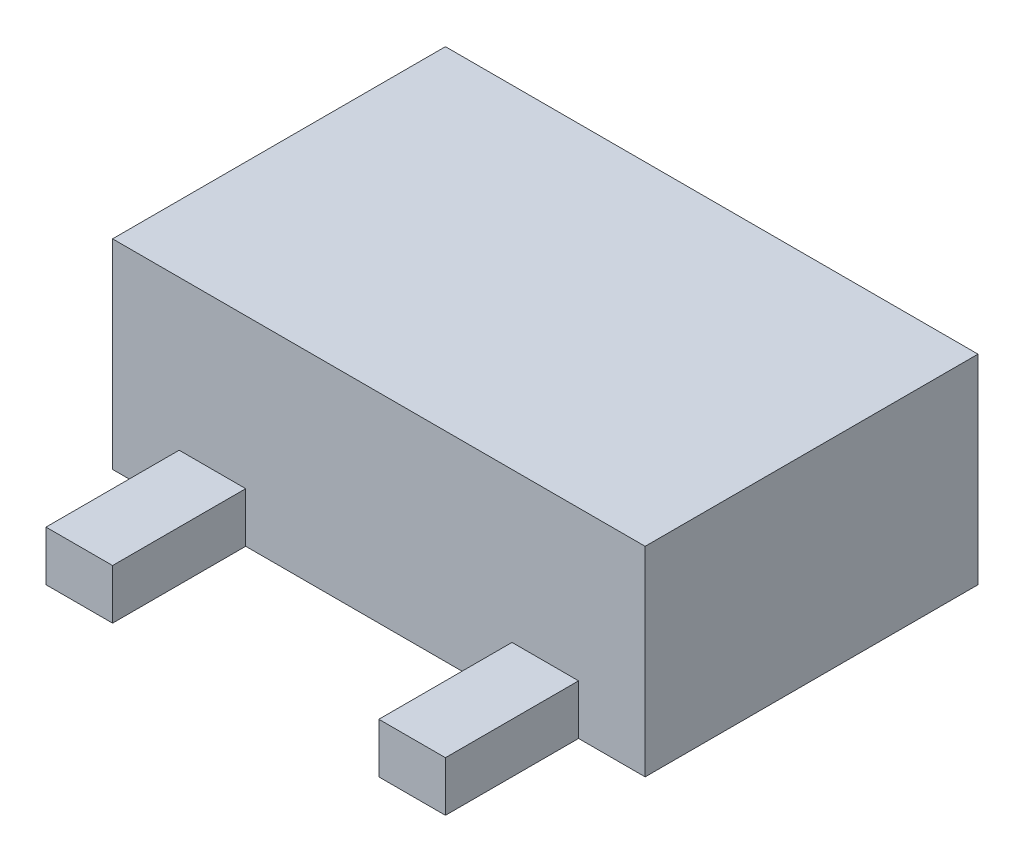
ISO-10303-21;
HEADER;
FILE_DESCRIPTION(('STEP AP214'),'2;1');
FILE_NAME('part.step','',(''),(''),'','','');
FILE_SCHEMA(('AUTOMOTIVE_DESIGN { 1 0 10303 214 1 1 1 1 }'));
ENDSEC;
DATA;
#1=APPLICATION_CONTEXT('core data for automotive mechanical design processes');
#2=APPLICATION_PROTOCOL_DEFINITION('international standard','automotive_design',2000,#1);
#3=PRODUCT_CONTEXT('',#1,'mechanical');
#4=PRODUCT('Part','Part','',(#3));
#5=PRODUCT_RELATED_PRODUCT_CATEGORY('part','',(#4));
#6=PRODUCT_DEFINITION_FORMATION('','',#4);
#7=PRODUCT_DEFINITION_CONTEXT('part definition',#1,'design');
#8=PRODUCT_DEFINITION('design','',#6,#7);
#9=PRODUCT_DEFINITION_SHAPE('','',#8);
#10=(LENGTH_UNIT() NAMED_UNIT(*) SI_UNIT(.MILLI.,.METRE.));
#11=(NAMED_UNIT(*) PLANE_ANGLE_UNIT() SI_UNIT($,.RADIAN.));
#12=(NAMED_UNIT(*) SI_UNIT($,.STERADIAN.) SOLID_ANGLE_UNIT());
#13=UNCERTAINTY_MEASURE_WITH_UNIT(LENGTH_MEASURE(1.E-05),#10,'distance_accuracy_value','');
#14=(GEOMETRIC_REPRESENTATION_CONTEXT(3) GLOBAL_UNCERTAINTY_ASSIGNED_CONTEXT((#13)) GLOBAL_UNIT_ASSIGNED_CONTEXT((#10,
#11,#12)) REPRESENTATION_CONTEXT('',''));
#15=CARTESIAN_POINT('',(0.,0.,0.));
#16=DIRECTION('',(0.,0.,1.));
#17=DIRECTION('',(1.,0.,0.));
#18=AXIS2_PLACEMENT_3D('',#15,#16,#17);
#19=CARTESIAN_POINT('',(-0.8,0.6,0.5));
#20=DIRECTION('',(0.,0.,-1.));
#21=DIRECTION('',(-1.,0.,0.));
#22=AXIS2_PLACEMENT_3D('',#19,#20,#21);
#23=PLANE('',#22);
#24=DIRECTION('',(-1.,0.,0.));
#25=VECTOR('',#24,1.);
#26=CARTESIAN_POINT('',(0.6,0.15,0.5));
#27=LINE('',#26,#25);
#28=CARTESIAN_POINT('',(0.6,0.15,0.5));
#29=VERTEX_POINT('',#28);
#30=CARTESIAN_POINT('',(0.4,0.15,0.5));
#31=VERTEX_POINT('',#30);
#32=EDGE_CURVE('E58',#29,#31,#27,.T.);
#33=ORIENTED_EDGE('',*,*,#32,.F.);
#34=DIRECTION('',(0.,-1.,0.));
#35=VECTOR('',#34,1.);
#36=CARTESIAN_POINT('',(0.6,0.597213595499958,0.5));
#37=LINE('',#36,#35);
#38=CARTESIAN_POINT('',(0.6,0.,0.5));
#39=VERTEX_POINT('',#38);
#40=EDGE_CURVE('E166',#29,#39,#37,.T.);
#41=ORIENTED_EDGE('',*,*,#40,.T.);
#42=DIRECTION('',(1.,0.,0.));
#43=VECTOR('',#42,1.);
#44=CARTESIAN_POINT('',(-0.8,0.,0.5));
#45=LINE('',#44,#43);
#46=CARTESIAN_POINT('',(0.8,0.,0.5));
#47=VERTEX_POINT('',#46);
#48=EDGE_CURVE('E151',#39,#47,#45,.T.);
#49=ORIENTED_EDGE('',*,*,#48,.T.);
#50=DIRECTION('',(0.,-1.,0.));
#51=VECTOR('',#50,1.);
#52=CARTESIAN_POINT('',(0.8,0.6,0.5));
#53=LINE('',#52,#51);
#54=CARTESIAN_POINT('',(0.8,0.6,0.5));
#55=VERTEX_POINT('',#54);
#56=EDGE_CURVE('E253',#55,#47,#53,.T.);
#57=ORIENTED_EDGE('',*,*,#56,.F.);
#58=DIRECTION('',(1.,0.,0.));
#59=VECTOR('',#58,1.);
#60=CARTESIAN_POINT('',(-0.8,0.6,0.5));
#61=LINE('',#60,#59);
#62=CARTESIAN_POINT('',(-0.8,0.6,0.5));
#63=VERTEX_POINT('',#62);
#64=EDGE_CURVE('E251',#63,#55,#61,.T.);
#65=ORIENTED_EDGE('',*,*,#64,.F.);
#66=DIRECTION('',(0.,-1.,0.));
#67=VECTOR('',#66,1.);
#68=CARTESIAN_POINT('',(-0.8,0.6,0.5));
#69=LINE('',#68,#67);
#70=CARTESIAN_POINT('',(-0.8,0.,0.5));
#71=VERTEX_POINT('',#70);
#72=EDGE_CURVE('E262',#63,#71,#69,.T.);
#73=ORIENTED_EDGE('',*,*,#72,.T.);
#74=CARTESIAN_POINT('',(-0.6,0.,0.5));
#75=VERTEX_POINT('',#74);
#76=EDGE_CURVE('E164',#71,#75,#45,.T.);
#77=ORIENTED_EDGE('',*,*,#76,.T.);
#78=DIRECTION('',(0.,-1.,0.));
#79=VECTOR('',#78,1.);
#80=CARTESIAN_POINT('',(-0.6,0.597213595499958,0.5));
#81=LINE('',#80,#79);
#82=CARTESIAN_POINT('',(-0.6,0.15,0.5));
#83=VERTEX_POINT('',#82);
#84=EDGE_CURVE('E209',#83,#75,#81,.T.);
#85=ORIENTED_EDGE('',*,*,#84,.F.);
#86=DIRECTION('',(1.,0.,0.));
#87=VECTOR('',#86,1.);
#88=CARTESIAN_POINT('',(-0.6,0.15,0.5));
#89=LINE('',#88,#87);
#90=CARTESIAN_POINT('',(-0.4,0.15,0.5));
#91=VERTEX_POINT('',#90);
#92=EDGE_CURVE('E195',#83,#91,#89,.T.);
#93=ORIENTED_EDGE('',*,*,#92,.T.);
#94=DIRECTION('',(0.,-1.,0.));
#95=VECTOR('',#94,1.);
#96=CARTESIAN_POINT('',(-0.4,0.597213595499958,0.5));
#97=LINE('',#96,#95);
#98=CARTESIAN_POINT('',(-0.4,0.,0.5));
#99=VERTEX_POINT('',#98);
#100=EDGE_CURVE('E211',#91,#99,#97,.T.);
#101=ORIENTED_EDGE('',*,*,#100,.T.);
#102=CARTESIAN_POINT('',(0.4,0.,0.5));
#103=VERTEX_POINT('',#102);
#104=EDGE_CURVE('E161',#99,#103,#45,.T.);
#105=ORIENTED_EDGE('',*,*,#104,.T.);
#106=DIRECTION('',(0.,-1.,0.));
#107=VECTOR('',#106,1.);
#108=CARTESIAN_POINT('',(0.4,0.597213595499958,0.5));
#109=LINE('',#108,#107);
#110=EDGE_CURVE('E54',#31,#103,#109,.T.);
#111=ORIENTED_EDGE('',*,*,#110,.F.);
#112=EDGE_LOOP('',(#33,#41,#49,#57,#65,#73,#77,#85,#93,#101,#105,#111));
#113=FACE_BOUND('',#112,.T.);
#114=ADVANCED_FACE('F39',(#113),#23,.F.);
#115=CARTESIAN_POINT('',(-0.8,0.6,-0.5));
#116=DIRECTION('',(0.,0.,1.));
#117=DIRECTION('',(1.,0.,0.));
#118=AXIS2_PLACEMENT_3D('',#115,#116,#117);
#119=PLANE('',#118);
#120=DIRECTION('',(0.,-1.,0.));
#121=VECTOR('',#120,1.);
#122=CARTESIAN_POINT('',(0.1,0.15,-0.500000000000001));
#123=LINE('',#122,#121);
#124=CARTESIAN_POINT('',(0.1,0.15,-0.500000000000001));
#125=VERTEX_POINT('',#124);
#126=CARTESIAN_POINT('',(0.1,0.,-0.500000000000001));
#127=VERTEX_POINT('',#126);
#128=EDGE_CURVE('E239',#125,#127,#123,.T.);
#129=ORIENTED_EDGE('',*,*,#128,.F.);
#130=DIRECTION('',(1.,0.,0.));
#131=VECTOR('',#130,1.);
#132=CARTESIAN_POINT('',(-0.1,0.15,-0.500000000000001));
#133=LINE('',#132,#131);
#134=CARTESIAN_POINT('',(-0.1,0.15,-0.500000000000001));
#135=VERTEX_POINT('',#134);
#136=EDGE_CURVE('E222',#135,#125,#133,.T.);
#137=ORIENTED_EDGE('',*,*,#136,.F.);
#138=DIRECTION('',(0.,-1.,0.));
#139=VECTOR('',#138,1.);
#140=CARTESIAN_POINT('',(-0.1,0.15,-0.500000000000001));
#141=LINE('',#140,#139);
#142=CARTESIAN_POINT('',(-0.1,0.,-0.5));
#143=VERTEX_POINT('',#142);
#144=EDGE_CURVE('E241',#135,#143,#141,.T.);
#145=ORIENTED_EDGE('',*,*,#144,.T.);
#146=DIRECTION('',(-1.,0.,0.));
#147=VECTOR('',#146,1.);
#148=CARTESIAN_POINT('',(-0.8,0.,-0.5));
#149=LINE('',#148,#147);
#150=CARTESIAN_POINT('',(-0.8,0.,-0.5));
#151=VERTEX_POINT('',#150);
#152=EDGE_CURVE('E255',#143,#151,#149,.T.);
#153=ORIENTED_EDGE('',*,*,#152,.T.);
#154=DIRECTION('',(0.,-1.,0.));
#155=VECTOR('',#154,1.);
#156=CARTESIAN_POINT('',(-0.8,0.6,-0.5));
#157=LINE('',#156,#155);
#158=CARTESIAN_POINT('',(-0.8,0.6,-0.5));
#159=VERTEX_POINT('',#158);
#160=EDGE_CURVE('E47',#159,#151,#157,.T.);
#161=ORIENTED_EDGE('',*,*,#160,.F.);
#162=DIRECTION('',(-1.,0.,0.));
#163=VECTOR('',#162,1.);
#164=CARTESIAN_POINT('',(-0.8,0.6,-0.5));
#165=LINE('',#164,#163);
#166=CARTESIAN_POINT('',(0.8,0.6,-0.5));
#167=VERTEX_POINT('',#166);
#168=EDGE_CURVE('E247',#167,#159,#165,.T.);
#169=ORIENTED_EDGE('',*,*,#168,.F.);
#170=DIRECTION('',(0.,-1.,0.));
#171=VECTOR('',#170,1.);
#172=CARTESIAN_POINT('',(0.8,0.6,-0.5));
#173=LINE('',#172,#171);
#174=CARTESIAN_POINT('',(0.8,0.,-0.5));
#175=VERTEX_POINT('',#174);
#176=EDGE_CURVE('E11',#167,#175,#173,.T.);
#177=ORIENTED_EDGE('',*,*,#176,.T.);
#178=EDGE_CURVE('E256',#175,#127,#149,.T.);
#179=ORIENTED_EDGE('',*,*,#178,.T.);
#180=EDGE_LOOP('',(#129,#137,#145,#153,#161,#169,#177,#179));
#181=FACE_BOUND('',#180,.T.);
#182=ADVANCED_FACE('F284',(#181),#119,.F.);
#183=CARTESIAN_POINT('',(0.8,0.6,-0.5));
#184=DIRECTION('',(-1.,0.,0.));
#185=DIRECTION('',(0.,0.,1.));
#186=AXIS2_PLACEMENT_3D('',#183,#184,#185);
#187=PLANE('',#186);
#188=DIRECTION('',(0.,0.,-1.));
#189=VECTOR('',#188,1.);
#190=CARTESIAN_POINT('',(0.8,0.,-0.5));
#191=LINE('',#190,#189);
#192=EDGE_CURVE('E158',#47,#175,#191,.T.);
#193=ORIENTED_EDGE('',*,*,#192,.T.);
#194=ORIENTED_EDGE('',*,*,#176,.F.);
#195=DIRECTION('',(0.,0.,-1.));
#196=VECTOR('',#195,1.);
#197=CARTESIAN_POINT('',(0.8,0.6,-0.5));
#198=LINE('',#197,#196);
#199=EDGE_CURVE('E244',#55,#167,#198,.T.);
#200=ORIENTED_EDGE('',*,*,#199,.F.);
#201=ORIENTED_EDGE('',*,*,#56,.T.);
#202=EDGE_LOOP('',(#193,#194,#200,#201));
#203=FACE_BOUND('',#202,.T.);
#204=ADVANCED_FACE('F41',(#203),#187,.F.);
#205=CARTESIAN_POINT('',(-0.8,0.6,-0.5));
#206=DIRECTION('',(1.,0.,0.));
#207=DIRECTION('',(0.,0.,-1.));
#208=AXIS2_PLACEMENT_3D('',#205,#206,#207);
#209=PLANE('',#208);
#210=DIRECTION('',(0.,0.,1.));
#211=VECTOR('',#210,1.);
#212=CARTESIAN_POINT('',(-0.8,0.,-0.5));
#213=LINE('',#212,#211);
#214=EDGE_CURVE('E162',#151,#71,#213,.T.);
#215=ORIENTED_EDGE('',*,*,#214,.T.);
#216=ORIENTED_EDGE('',*,*,#72,.F.);
#217=DIRECTION('',(0.,0.,1.));
#218=VECTOR('',#217,1.);
#219=CARTESIAN_POINT('',(-0.8,0.6,-0.5));
#220=LINE('',#219,#218);
#221=EDGE_CURVE('E249',#159,#63,#220,.T.);
#222=ORIENTED_EDGE('',*,*,#221,.F.);
#223=ORIENTED_EDGE('',*,*,#160,.T.);
#224=EDGE_LOOP('',(#215,#216,#222,#223));
#225=FACE_BOUND('',#224,.T.);
#226=ADVANCED_FACE('F269',(#225),#209,.F.);
#227=CARTESIAN_POINT('',(0.,0.6,0.));
#228=DIRECTION('',(0.,1.,0.));
#229=DIRECTION('',(0.,0.,1.));
#230=AXIS2_PLACEMENT_3D('',#227,#228,#229);
#231=PLANE('',#230);
#232=ORIENTED_EDGE('',*,*,#199,.T.);
#233=ORIENTED_EDGE('',*,*,#168,.T.);
#234=ORIENTED_EDGE('',*,*,#221,.T.);
#235=ORIENTED_EDGE('',*,*,#64,.T.);
#236=EDGE_LOOP('',(#232,#233,#234,#235));
#237=FACE_BOUND('',#236,.T.);
#238=ADVANCED_FACE('F281',(#237),#231,.T.);
#239=CARTESIAN_POINT('',(0.,0.,0.));
#240=DIRECTION('',(0.,1.,0.));
#241=DIRECTION('',(0.,0.,1.));
#242=AXIS2_PLACEMENT_3D('',#239,#240,#241);
#243=PLANE('',#242);
#244=ORIENTED_EDGE('',*,*,#192,.F.);
#245=ORIENTED_EDGE('',*,*,#48,.F.);
#246=DIRECTION('',(0.,0.,1.));
#247=VECTOR('',#246,1.);
#248=CARTESIAN_POINT('',(0.6,0.,0.5));
#249=LINE('',#248,#247);
#250=CARTESIAN_POINT('',(0.6,0.,0.9));
#251=VERTEX_POINT('',#250);
#252=EDGE_CURVE('E155',#39,#251,#249,.T.);
#253=ORIENTED_EDGE('',*,*,#252,.T.);
#254=DIRECTION('',(-1.,0.,0.));
#255=VECTOR('',#254,1.);
#256=CARTESIAN_POINT('',(0.6,0.,0.9));
#257=LINE('',#256,#255);
#258=CARTESIAN_POINT('',(0.4,0.,0.9));
#259=VERTEX_POINT('',#258);
#260=EDGE_CURVE('E177',#251,#259,#257,.T.);
#261=ORIENTED_EDGE('',*,*,#260,.T.);
#262=DIRECTION('',(0.,0.,-1.));
#263=VECTOR('',#262,1.);
#264=CARTESIAN_POINT('',(0.4,0.,0.5));
#265=LINE('',#264,#263);
#266=EDGE_CURVE('E174',#259,#103,#265,.T.);
#267=ORIENTED_EDGE('',*,*,#266,.T.);
#268=ORIENTED_EDGE('',*,*,#104,.F.);
#269=DIRECTION('',(0.,0.,-1.));
#270=VECTOR('',#269,1.);
#271=CARTESIAN_POINT('',(-0.4,0.,0.5));
#272=LINE('',#271,#270);
#273=CARTESIAN_POINT('',(-0.4,0.,0.9));
#274=VERTEX_POINT('',#273);
#275=EDGE_CURVE('E207',#274,#99,#272,.T.);
#276=ORIENTED_EDGE('',*,*,#275,.F.);
#277=DIRECTION('',(1.,0.,0.));
#278=VECTOR('',#277,1.);
#279=CARTESIAN_POINT('',(-0.6,0.,0.9));
#280=LINE('',#279,#278);
#281=CARTESIAN_POINT('',(-0.6,0.,0.9));
#282=VERTEX_POINT('',#281);
#283=EDGE_CURVE('E204',#282,#274,#280,.T.);
#284=ORIENTED_EDGE('',*,*,#283,.F.);
#285=DIRECTION('',(0.,0.,1.));
#286=VECTOR('',#285,1.);
#287=CARTESIAN_POINT('',(-0.6,0.,0.5));
#288=LINE('',#287,#286);
#289=EDGE_CURVE('E190',#75,#282,#288,.T.);
#290=ORIENTED_EDGE('',*,*,#289,.F.);
#291=ORIENTED_EDGE('',*,*,#76,.F.);
#292=ORIENTED_EDGE('',*,*,#214,.F.);
#293=ORIENTED_EDGE('',*,*,#152,.F.);
#294=DIRECTION('',(0.,0.,1.));
#295=VECTOR('',#294,1.);
#296=CARTESIAN_POINT('',(-0.1,0.,-0.500000000000001));
#297=LINE('',#296,#295);
#298=CARTESIAN_POINT('',(-0.1,0.,-0.900000000000001));
#299=VERTEX_POINT('',#298);
#300=EDGE_CURVE('E201',#299,#143,#297,.T.);
#301=ORIENTED_EDGE('',*,*,#300,.F.);
#302=DIRECTION('',(-1.,0.,0.));
#303=VECTOR('',#302,1.);
#304=CARTESIAN_POINT('',(-0.1,0.,-0.900000000000001));
#305=LINE('',#304,#303);
#306=CARTESIAN_POINT('',(0.1,0.,-0.9));
#307=VERTEX_POINT('',#306);
#308=EDGE_CURVE('E223',#307,#299,#305,.T.);
#309=ORIENTED_EDGE('',*,*,#308,.F.);
#310=DIRECTION('',(0.,0.,-1.));
#311=VECTOR('',#310,1.);
#312=CARTESIAN_POINT('',(0.1,0.,-0.500000000000001));
#313=LINE('',#312,#311);
#314=EDGE_CURVE('E231',#127,#307,#313,.T.);
#315=ORIENTED_EDGE('',*,*,#314,.F.);
#316=ORIENTED_EDGE('',*,*,#178,.F.);
#317=EDGE_LOOP('',(#244,#245,#253,#261,#267,#268,#276,#284,#290,#291,#292,#293,#301,#309,#315,#316));
#318=FACE_BOUND('',#317,.T.);
#319=ADVANCED_FACE('F152',(#318),#243,.F.);
#320=CARTESIAN_POINT('',(-0.1,0.15,-0.500000000000001));
#321=DIRECTION('',(1.,0.,0.));
#322=DIRECTION('',(0.,0.,-1.));
#323=AXIS2_PLACEMENT_3D('',#320,#321,#322);
#324=PLANE('',#323);
#325=ORIENTED_EDGE('',*,*,#300,.T.);
#326=ORIENTED_EDGE('',*,*,#144,.F.);
#327=DIRECTION('',(0.,0.,1.));
#328=VECTOR('',#327,1.);
#329=CARTESIAN_POINT('',(-0.1,0.15,-0.500000000000001));
#330=LINE('',#329,#328);
#331=CARTESIAN_POINT('',(-0.1,0.15,-0.900000000000001));
#332=VERTEX_POINT('',#331);
#333=EDGE_CURVE('E220',#332,#135,#330,.T.);
#334=ORIENTED_EDGE('',*,*,#333,.F.);
#335=DIRECTION('',(0.,-1.,0.));
#336=VECTOR('',#335,1.);
#337=CARTESIAN_POINT('',(-0.1,0.15,-0.900000000000001));
#338=LINE('',#337,#336);
#339=EDGE_CURVE('E229',#332,#299,#338,.T.);
#340=ORIENTED_EDGE('',*,*,#339,.T.);
#341=EDGE_LOOP('',(#325,#326,#334,#340));
#342=FACE_BOUND('',#341,.T.);
#343=ADVANCED_FACE('F299',(#342),#324,.F.);
#344=CARTESIAN_POINT('',(0.1,0.15,-0.500000000000001));
#345=DIRECTION('',(-1.,0.,0.));
#346=DIRECTION('',(0.,0.,1.));
#347=AXIS2_PLACEMENT_3D('',#344,#345,#346);
#348=PLANE('',#347);
#349=ORIENTED_EDGE('',*,*,#314,.T.);
#350=DIRECTION('',(0.,-1.,0.));
#351=VECTOR('',#350,1.);
#352=CARTESIAN_POINT('',(0.1,0.15,-0.9));
#353=LINE('',#352,#351);
#354=CARTESIAN_POINT('',(0.1,0.15,-0.9));
#355=VERTEX_POINT('',#354);
#356=EDGE_CURVE('E236',#355,#307,#353,.T.);
#357=ORIENTED_EDGE('',*,*,#356,.F.);
#358=DIRECTION('',(0.,0.,-1.));
#359=VECTOR('',#358,1.);
#360=CARTESIAN_POINT('',(0.1,0.15,-0.500000000000001));
#361=LINE('',#360,#359);
#362=EDGE_CURVE('E225',#125,#355,#361,.T.);
#363=ORIENTED_EDGE('',*,*,#362,.F.);
#364=ORIENTED_EDGE('',*,*,#128,.T.);
#365=EDGE_LOOP('',(#349,#357,#363,#364));
#366=FACE_BOUND('',#365,.T.);
#367=ADVANCED_FACE('F304',(#366),#348,.F.);
#368=CARTESIAN_POINT('',(-0.1,0.15,-0.900000000000001));
#369=DIRECTION('',(0.,0.,1.));
#370=DIRECTION('',(1.,0.,0.));
#371=AXIS2_PLACEMENT_3D('',#368,#369,#370);
#372=PLANE('',#371);
#373=ORIENTED_EDGE('',*,*,#308,.T.);
#374=ORIENTED_EDGE('',*,*,#339,.F.);
#375=DIRECTION('',(-1.,0.,0.));
#376=VECTOR('',#375,1.);
#377=CARTESIAN_POINT('',(-0.1,0.15,-0.900000000000001));
#378=LINE('',#377,#376);
#379=EDGE_CURVE('E227',#355,#332,#378,.T.);
#380=ORIENTED_EDGE('',*,*,#379,.F.);
#381=ORIENTED_EDGE('',*,*,#356,.T.);
#382=EDGE_LOOP('',(#373,#374,#380,#381));
#383=FACE_BOUND('',#382,.T.);
#384=ADVANCED_FACE('F308',(#383),#372,.F.);
#385=CARTESIAN_POINT('',(0.,0.15,0.));
#386=DIRECTION('',(0.,-1.,0.));
#387=DIRECTION('',(0.,0.,-1.));
#388=AXIS2_PLACEMENT_3D('',#385,#386,#387);
#389=PLANE('',#388);
#390=ORIENTED_EDGE('',*,*,#333,.T.);
#391=ORIENTED_EDGE('',*,*,#136,.T.);
#392=ORIENTED_EDGE('',*,*,#362,.T.);
#393=ORIENTED_EDGE('',*,*,#379,.T.);
#394=EDGE_LOOP('',(#390,#391,#392,#393));
#395=FACE_BOUND('',#394,.T.);
#396=ADVANCED_FACE('F312',(#395),#389,.F.);
#397=CARTESIAN_POINT('',(-0.4,0.597213595499958,0.5));
#398=DIRECTION('',(-1.,0.,0.));
#399=DIRECTION('',(0.,0.,1.));
#400=AXIS2_PLACEMENT_3D('',#397,#398,#399);
#401=PLANE('',#400);
#402=ORIENTED_EDGE('',*,*,#100,.F.);
#403=DIRECTION('',(0.,0.,1.));
#404=VECTOR('',#403,1.);
#405=CARTESIAN_POINT('',(-0.4,0.15,0.5));
#406=LINE('',#405,#404);
#407=CARTESIAN_POINT('',(-0.4,0.15,0.9));
#408=VERTEX_POINT('',#407);
#409=EDGE_CURVE('E191',#91,#408,#406,.T.);
#410=ORIENTED_EDGE('',*,*,#409,.T.);
#411=DIRECTION('',(0.,-1.,0.));
#412=VECTOR('',#411,1.);
#413=CARTESIAN_POINT('',(-0.4,0.597213595499958,0.9));
#414=LINE('',#413,#412);
#415=EDGE_CURVE('E214',#408,#274,#414,.T.);
#416=ORIENTED_EDGE('',*,*,#415,.T.);
#417=ORIENTED_EDGE('',*,*,#275,.T.);
#418=EDGE_LOOP('',(#402,#410,#416,#417));
#419=FACE_BOUND('',#418,.T.);
#420=ADVANCED_FACE('F316',(#419),#401,.F.);
#421=CARTESIAN_POINT('',(-0.6,0.597213595499958,0.9));
#422=DIRECTION('',(0.,0.,-1.));
#423=DIRECTION('',(-1.,0.,0.));
#424=AXIS2_PLACEMENT_3D('',#421,#422,#423);
#425=PLANE('',#424);
#426=ORIENTED_EDGE('',*,*,#415,.F.);
#427=DIRECTION('',(-1.,0.,0.));
#428=VECTOR('',#427,1.);
#429=CARTESIAN_POINT('',(-0.6,0.15,0.9));
#430=LINE('',#429,#428);
#431=CARTESIAN_POINT('',(-0.6,0.15,0.9));
#432=VERTEX_POINT('',#431);
#433=EDGE_CURVE('E194',#408,#432,#430,.T.);
#434=ORIENTED_EDGE('',*,*,#433,.T.);
#435=DIRECTION('',(0.,-1.,0.));
#436=VECTOR('',#435,1.);
#437=CARTESIAN_POINT('',(-0.6,0.597213595499958,0.9));
#438=LINE('',#437,#436);
#439=EDGE_CURVE('E216',#432,#282,#438,.T.);
#440=ORIENTED_EDGE('',*,*,#439,.T.);
#441=ORIENTED_EDGE('',*,*,#283,.T.);
#442=EDGE_LOOP('',(#426,#434,#440,#441));
#443=FACE_BOUND('',#442,.T.);
#444=ADVANCED_FACE('F322',(#443),#425,.F.);
#445=CARTESIAN_POINT('',(-0.6,0.597213595499958,0.5));
#446=DIRECTION('',(1.,0.,0.));
#447=DIRECTION('',(0.,0.,-1.));
#448=AXIS2_PLACEMENT_3D('',#445,#446,#447);
#449=PLANE('',#448);
#450=ORIENTED_EDGE('',*,*,#439,.F.);
#451=DIRECTION('',(0.,0.,-1.));
#452=VECTOR('',#451,1.);
#453=CARTESIAN_POINT('',(-0.6,0.15,0.5));
#454=LINE('',#453,#452);
#455=EDGE_CURVE('E198',#432,#83,#454,.T.);
#456=ORIENTED_EDGE('',*,*,#455,.T.);
#457=ORIENTED_EDGE('',*,*,#84,.T.);
#458=ORIENTED_EDGE('',*,*,#289,.T.);
#459=EDGE_LOOP('',(#450,#456,#457,#458));
#460=FACE_BOUND('',#459,.T.);
#461=ADVANCED_FACE('F318',(#460),#449,.F.);
#462=CARTESIAN_POINT('',(0.,0.15,0.));
#463=DIRECTION('',(0.,-1.,0.));
#464=DIRECTION('',(0.,0.,-1.));
#465=AXIS2_PLACEMENT_3D('',#462,#463,#464);
#466=PLANE('',#465);
#467=ORIENTED_EDGE('',*,*,#433,.F.);
#468=ORIENTED_EDGE('',*,*,#409,.F.);
#469=ORIENTED_EDGE('',*,*,#92,.F.);
#470=ORIENTED_EDGE('',*,*,#455,.F.);
#471=EDGE_LOOP('',(#467,#468,#469,#470));
#472=FACE_BOUND('',#471,.T.);
#473=ADVANCED_FACE('F321',(#472),#466,.F.);
#474=CARTESIAN_POINT('',(0.6,0.597213595499958,0.5));
#475=DIRECTION('',(1.,0.,0.));
#476=DIRECTION('',(0.,0.,-1.));
#477=AXIS2_PLACEMENT_3D('',#474,#475,#476);
#478=PLANE('',#477);
#479=DIRECTION('',(0.,0.,-1.));
#480=VECTOR('',#479,1.);
#481=CARTESIAN_POINT('',(0.6,0.15,0.5));
#482=LINE('',#481,#480);
#483=CARTESIAN_POINT('',(0.6,0.15,0.9));
#484=VERTEX_POINT('',#483);
#485=EDGE_CURVE('E180',#484,#29,#482,.T.);
#486=ORIENTED_EDGE('',*,*,#485,.F.);
#487=DIRECTION('',(0.,-1.,0.));
#488=VECTOR('',#487,1.);
#489=CARTESIAN_POINT('',(0.6,0.597213595499958,0.9));
#490=LINE('',#489,#488);
#491=EDGE_CURVE('E173',#484,#251,#490,.T.);
#492=ORIENTED_EDGE('',*,*,#491,.T.);
#493=ORIENTED_EDGE('',*,*,#252,.F.);
#494=ORIENTED_EDGE('',*,*,#40,.F.);
#495=EDGE_LOOP('',(#486,#492,#493,#494));
#496=FACE_BOUND('',#495,.T.);
#497=ADVANCED_FACE('F171',(#496),#478,.T.);
#498=CARTESIAN_POINT('',(0.4,0.597213595499958,0.5));
#499=DIRECTION('',(-1.,0.,0.));
#500=DIRECTION('',(0.,0.,1.));
#501=AXIS2_PLACEMENT_3D('',#498,#499,#500);
#502=PLANE('',#501);
#503=DIRECTION('',(0.,0.,1.));
#504=VECTOR('',#503,1.);
#505=CARTESIAN_POINT('',(0.4,0.15,0.5));
#506=LINE('',#505,#504);
#507=CARTESIAN_POINT('',(0.4,0.15,0.9));
#508=VERTEX_POINT('',#507);
#509=EDGE_CURVE('E169',#31,#508,#506,.T.);
#510=ORIENTED_EDGE('',*,*,#509,.F.);
#511=ORIENTED_EDGE('',*,*,#110,.T.);
#512=ORIENTED_EDGE('',*,*,#266,.F.);
#513=DIRECTION('',(0.,-1.,0.));
#514=VECTOR('',#513,1.);
#515=CARTESIAN_POINT('',(0.4,0.597213595499958,0.9));
#516=LINE('',#515,#514);
#517=EDGE_CURVE('E185',#508,#259,#516,.T.);
#518=ORIENTED_EDGE('',*,*,#517,.F.);
#519=EDGE_LOOP('',(#510,#511,#512,#518));
#520=FACE_BOUND('',#519,.T.);
#521=ADVANCED_FACE('F335',(#520),#502,.T.);
#522=CARTESIAN_POINT('',(0.6,0.597213595499958,0.9));
#523=DIRECTION('',(0.,0.,1.));
#524=DIRECTION('',(1.,0.,0.));
#525=AXIS2_PLACEMENT_3D('',#522,#523,#524);
#526=PLANE('',#525);
#527=DIRECTION('',(1.,0.,0.));
#528=VECTOR('',#527,1.);
#529=CARTESIAN_POINT('',(0.6,0.15,0.9));
#530=LINE('',#529,#528);
#531=EDGE_CURVE('E188',#508,#484,#530,.T.);
#532=ORIENTED_EDGE('',*,*,#531,.F.);
#533=ORIENTED_EDGE('',*,*,#517,.T.);
#534=ORIENTED_EDGE('',*,*,#260,.F.);
#535=ORIENTED_EDGE('',*,*,#491,.F.);
#536=EDGE_LOOP('',(#532,#533,#534,#535));
#537=FACE_BOUND('',#536,.T.);
#538=ADVANCED_FACE('F338',(#537),#526,.T.);
#539=CARTESIAN_POINT('',(0.,0.15,0.));
#540=DIRECTION('',(0.,-1.,0.));
#541=DIRECTION('',(0.,0.,-1.));
#542=AXIS2_PLACEMENT_3D('',#539,#540,#541);
#543=PLANE('',#542);
#544=ORIENTED_EDGE('',*,*,#485,.T.);
#545=ORIENTED_EDGE('',*,*,#32,.T.);
#546=ORIENTED_EDGE('',*,*,#509,.T.);
#547=ORIENTED_EDGE('',*,*,#531,.T.);
#548=EDGE_LOOP('',(#544,#545,#546,#547));
#549=FACE_BOUND('',#548,.T.);
#550=ADVANCED_FACE('F342',(#549),#543,.F.);
#551=CLOSED_SHELL('',(#114,#182,#204,#226,#238,#319,#343,#367,#384,#396,#420,#444,#461,#473,
#497,#521,#538,#550));
#552=MANIFOLD_SOLID_BREP('B2',#551);
#553=ADVANCED_BREP_SHAPE_REPRESENTATION('',(#18,#552),#14);
#554=SHAPE_DEFINITION_REPRESENTATION(#9,#553);
ENDSEC;
END-ISO-10303-21;
